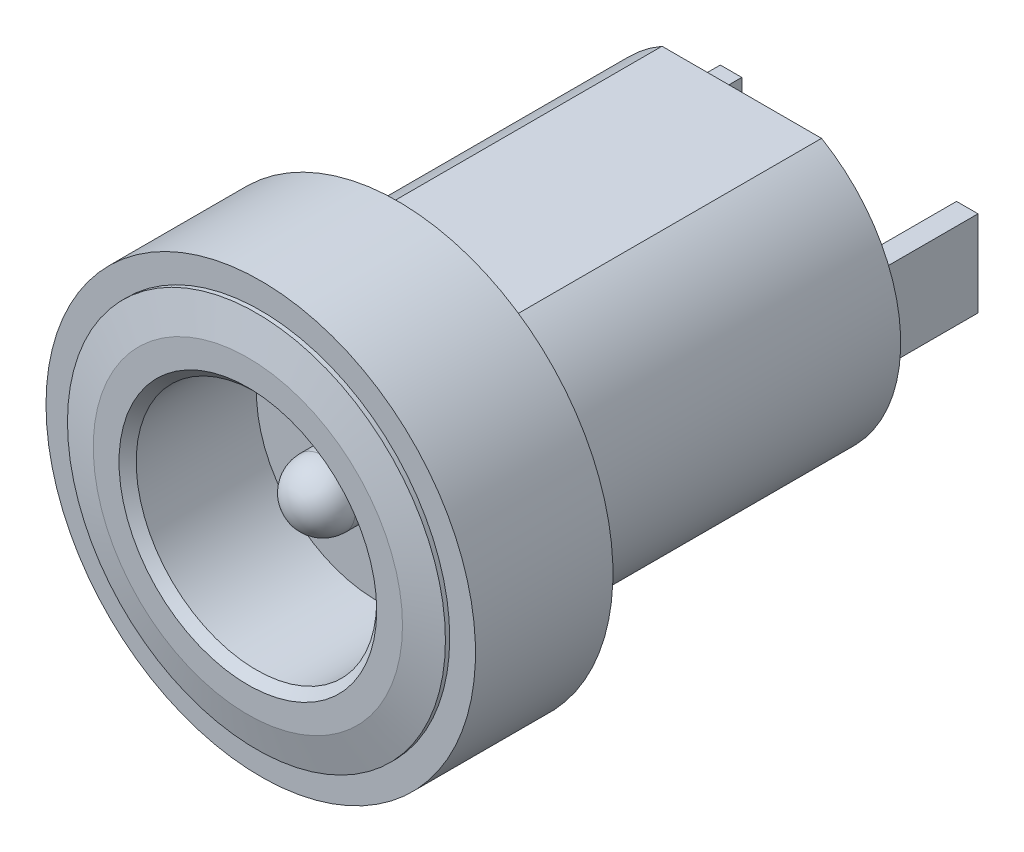
ISO-10303-21;
HEADER;
FILE_DESCRIPTION(('STEP AP214'),'2;1');
FILE_NAME('part.step','',(''),(''),'','','');
FILE_SCHEMA(('AUTOMOTIVE_DESIGN { 1 0 10303 214 1 1 1 1 }'));
ENDSEC;
DATA;
#1=APPLICATION_CONTEXT('core data for automotive mechanical design processes');
#2=APPLICATION_PROTOCOL_DEFINITION('international standard','automotive_design',2000,#1);
#3=PRODUCT_CONTEXT('',#1,'mechanical');
#4=PRODUCT('Part','Part','',(#3));
#5=PRODUCT_RELATED_PRODUCT_CATEGORY('part','',(#4));
#6=PRODUCT_DEFINITION_FORMATION('','',#4);
#7=PRODUCT_DEFINITION_CONTEXT('part definition',#1,'design');
#8=PRODUCT_DEFINITION('design','',#6,#7);
#9=PRODUCT_DEFINITION_SHAPE('','',#8);
#10=(LENGTH_UNIT() NAMED_UNIT(*) SI_UNIT(.MILLI.,.METRE.));
#11=(NAMED_UNIT(*) PLANE_ANGLE_UNIT() SI_UNIT($,.RADIAN.));
#12=(NAMED_UNIT(*) SI_UNIT($,.STERADIAN.) SOLID_ANGLE_UNIT());
#13=UNCERTAINTY_MEASURE_WITH_UNIT(LENGTH_MEASURE(1.E-05),#10,'distance_accuracy_value','');
#14=(GEOMETRIC_REPRESENTATION_CONTEXT(3) GLOBAL_UNCERTAINTY_ASSIGNED_CONTEXT((#13)) GLOBAL_UNIT_ASSIGNED_CONTEXT((#10,
#11,#12)) REPRESENTATION_CONTEXT('',''));
#15=CARTESIAN_POINT('',(0.,0.,0.));
#16=DIRECTION('',(0.,0.,1.));
#17=DIRECTION('',(1.,0.,0.));
#18=AXIS2_PLACEMENT_3D('',#15,#16,#17);
#19=CARTESIAN_POINT('',(0.,0.,0.));
#20=DIRECTION('',(0.,0.,1.));
#21=DIRECTION('',(1.,0.,0.));
#22=AXIS2_PLACEMENT_3D('',#19,#20,#21);
#23=PLANE('',#22);
#24=DIRECTION('',(1.,0.,0.));
#25=VECTOR('',#24,1.);
#26=CARTESIAN_POINT('',(0.928708781050336,-3.2,0.));
#27=LINE('',#26,#25);
#28=CARTESIAN_POINT('',(-1.85741756210067,-3.2,0.));
#29=VERTEX_POINT('',#28);
#30=CARTESIAN_POINT('',(1.85741756210067,-3.2,0.));
#31=VERTEX_POINT('',#30);
#32=EDGE_CURVE('E252',#29,#31,#27,.T.);
#33=ORIENTED_EDGE('',*,*,#32,.T.);
#34=CARTESIAN_POINT('',(0.,0.,0.));
#35=DIRECTION('',(0.,0.,1.));
#36=DIRECTION('',(1.,0.,0.));
#37=AXIS2_PLACEMENT_3D('',#34,#35,#36);
#38=CIRCLE('',#37,3.7);
#39=CARTESIAN_POINT('',(1.85741756210067,3.2,0.));
#40=VERTEX_POINT('',#39);
#41=EDGE_CURVE('E223',#31,#40,#38,.T.);
#42=ORIENTED_EDGE('',*,*,#41,.T.);
#43=DIRECTION('',(-1.,0.,0.));
#44=VECTOR('',#43,1.);
#45=CARTESIAN_POINT('',(-0.928708781050336,3.2,0.));
#46=LINE('',#45,#44);
#47=CARTESIAN_POINT('',(-1.85741756210067,3.2,0.));
#48=VERTEX_POINT('',#47);
#49=EDGE_CURVE('E203',#40,#48,#46,.T.);
#50=ORIENTED_EDGE('',*,*,#49,.T.);
#51=CARTESIAN_POINT('',(0.,0.,0.));
#52=DIRECTION('',(0.,0.,1.));
#53=DIRECTION('',(1.,0.,0.));
#54=AXIS2_PLACEMENT_3D('',#51,#52,#53);
#55=CIRCLE('',#54,3.7);
#56=EDGE_CURVE('E338',#48,#29,#55,.T.);
#57=ORIENTED_EDGE('',*,*,#56,.T.);
#58=EDGE_LOOP('',(#33,#42,#50,#57));
#59=FACE_BOUND('',#58,.T.);
#60=CARTESIAN_POINT('',(0.,0.,0.));
#61=DIRECTION('',(0.,0.,1.));
#62=DIRECTION('',(1.,0.,0.));
#63=AXIS2_PLACEMENT_3D('',#60,#61,#62);
#64=CIRCLE('',#63,5.);
#65=CARTESIAN_POINT('',(-5.,0.,0.));
#66=VERTEX_POINT('',#65);
#67=EDGE_CURVE('E11',#66,#66,#64,.T.);
#68=ORIENTED_EDGE('',*,*,#67,.F.);
#69=EDGE_LOOP('',(#68));
#70=FACE_BOUND('',#69,.T.);
#71=ADVANCED_FACE('F17',(#59,#70),#23,.F.);
#72=CARTESIAN_POINT('',(0.,0.,3.2));
#73=DIRECTION('',(0.,0.,1.));
#74=DIRECTION('',(1.,0.,0.));
#75=AXIS2_PLACEMENT_3D('',#72,#73,#74);
#76=PLANE('',#75);
#77=CARTESIAN_POINT('',(0.,0.,3.2));
#78=DIRECTION('',(0.,0.,-1.));
#79=DIRECTION('',(-1.,0.,0.));
#80=AXIS2_PLACEMENT_3D('',#77,#78,#79);
#81=CIRCLE('',#80,4.4);
#82=CARTESIAN_POINT('',(4.4,0.,3.2));
#83=VERTEX_POINT('',#82);
#84=EDGE_CURVE('E209',#83,#83,#81,.T.);
#85=ORIENTED_EDGE('',*,*,#84,.T.);
#86=EDGE_LOOP('',(#85));
#87=FACE_BOUND('',#86,.T.);
#88=CARTESIAN_POINT('',(0.,0.,3.2));
#89=DIRECTION('',(0.,0.,1.));
#90=DIRECTION('',(1.,0.,0.));
#91=AXIS2_PLACEMENT_3D('',#88,#89,#90);
#92=CIRCLE('',#91,5.);
#93=CARTESIAN_POINT('',(-5.,0.,3.2));
#94=VERTEX_POINT('',#93);
#95=EDGE_CURVE('E310',#94,#94,#92,.T.);
#96=ORIENTED_EDGE('',*,*,#95,.T.);
#97=EDGE_LOOP('',(#96));
#98=FACE_BOUND('',#97,.T.);
#99=ADVANCED_FACE('F386',(#87,#98),#76,.T.);
#100=CARTESIAN_POINT('',(0.,0.,0.));
#101=DIRECTION('',(0.,0.,1.));
#102=DIRECTION('',(1.,0.,0.));
#103=AXIS2_PLACEMENT_3D('',#100,#101,#102);
#104=CYLINDRICAL_SURFACE('',#103,5.);
#105=ORIENTED_EDGE('',*,*,#95,.F.);
#106=DIRECTION('',(0.,0.,-1.));
#107=VECTOR('',#106,1.);
#108=CARTESIAN_POINT('',(-5.,0.,0.));
#109=LINE('',#108,#107);
#110=EDGE_CURVE('E21',#94,#66,#109,.T.);
#111=ORIENTED_EDGE('',*,*,#110,.T.);
#112=ORIENTED_EDGE('',*,*,#67,.T.);
#113=ORIENTED_EDGE('',*,*,#110,.F.);
#114=EDGE_LOOP('',(#105,#111,#112,#113));
#115=FACE_BOUND('',#114,.T.);
#116=ADVANCED_FACE('F374',(#115),#104,.T.);
#117=CARTESIAN_POINT('',(0.,0.,0.5));
#118=DIRECTION('',(0.,0.,1.));
#119=DIRECTION('',(1.,0.,0.));
#120=AXIS2_PLACEMENT_3D('',#117,#118,#119);
#121=PLANE('',#120);
#122=CARTESIAN_POINT('',(0.,0.,0.5));
#123=DIRECTION('',(0.,0.,1.));
#124=DIRECTION('',(-1.,0.,0.));
#125=AXIS2_PLACEMENT_3D('',#122,#123,#124);
#126=CIRCLE('',#125,0.75);
#127=CARTESIAN_POINT('',(0.75,0.,0.5));
#128=VERTEX_POINT('',#127);
#129=EDGE_CURVE('E193',#128,#128,#126,.T.);
#130=ORIENTED_EDGE('',*,*,#129,.F.);
#131=EDGE_LOOP('',(#130));
#132=FACE_BOUND('',#131,.T.);
#133=CARTESIAN_POINT('',(0.,0.,0.5));
#134=DIRECTION('',(0.,0.,-1.));
#135=DIRECTION('',(-1.,0.,0.));
#136=AXIS2_PLACEMENT_3D('',#133,#134,#135);
#137=CIRCLE('',#136,2.8);
#138=CARTESIAN_POINT('',(2.8,0.,0.5));
#139=VERTEX_POINT('',#138);
#140=EDGE_CURVE('E280',#139,#139,#137,.T.);
#141=ORIENTED_EDGE('',*,*,#140,.F.);
#142=EDGE_LOOP('',(#141));
#143=FACE_BOUND('',#142,.T.);
#144=ADVANCED_FACE('F19',(#132,#143),#121,.T.);
#145=CARTESIAN_POINT('',(0.,0.,3.2));
#146=DIRECTION('',(0.,0.,1.));
#147=DIRECTION('',(-1.,0.,0.));
#148=AXIS2_PLACEMENT_3D('',#145,#146,#147);
#149=CYLINDRICAL_SURFACE('',#148,4.4);
#150=CARTESIAN_POINT('',(0.,0.,3.3));
#151=DIRECTION('',(0.,0.,1.));
#152=DIRECTION('',(-1.,0.,0.));
#153=AXIS2_PLACEMENT_3D('',#150,#151,#152);
#154=CIRCLE('',#153,4.4);
#155=CARTESIAN_POINT('',(4.4,0.,3.3));
#156=VERTEX_POINT('',#155);
#157=EDGE_CURVE('E210',#156,#156,#154,.T.);
#158=ORIENTED_EDGE('',*,*,#157,.F.);
#159=DIRECTION('',(0.,0.,-1.));
#160=VECTOR('',#159,1.);
#161=CARTESIAN_POINT('',(4.4,0.,3.2));
#162=LINE('',#161,#160);
#163=EDGE_CURVE('E205',#156,#83,#162,.T.);
#164=ORIENTED_EDGE('',*,*,#163,.T.);
#165=ORIENTED_EDGE('',*,*,#84,.F.);
#166=ORIENTED_EDGE('',*,*,#163,.F.);
#167=EDGE_LOOP('',(#158,#164,#165,#166));
#168=FACE_BOUND('',#167,.T.);
#169=ADVANCED_FACE('F373',(#168),#149,.T.);
#170=CARTESIAN_POINT('',(0.,0.,3.4));
#171=DIRECTION('',(0.,0.,-1.));
#172=DIRECTION('',(-1.,0.,0.));
#173=AXIS2_PLACEMENT_3D('',#170,#171,#172);
#174=CONICAL_SURFACE('',#173,4.,1.32581766366803);
#175=CARTESIAN_POINT('',(0.,0.,3.5));
#176=DIRECTION('',(0.,0.,-1.));
#177=DIRECTION('',(-1.,0.,0.));
#178=AXIS2_PLACEMENT_3D('',#175,#176,#177);
#179=CIRCLE('',#178,3.6);
#180=CARTESIAN_POINT('',(3.6,0.,3.5));
#181=VERTEX_POINT('',#180);
#182=EDGE_CURVE('E191',#181,#181,#179,.T.);
#183=ORIENTED_EDGE('',*,*,#182,.T.);
#184=DIRECTION('',(0.970142500145332,0.,-0.242535625036333));
#185=VECTOR('',#184,1.);
#186=CARTESIAN_POINT('',(4.,0.,3.4));
#187=LINE('',#186,#185);
#188=EDGE_CURVE('E276',#181,#156,#187,.T.);
#189=ORIENTED_EDGE('',*,*,#188,.T.);
#190=ORIENTED_EDGE('',*,*,#157,.T.);
#191=ORIENTED_EDGE('',*,*,#188,.F.);
#192=EDGE_LOOP('',(#183,#189,#190,#191));
#193=FACE_BOUND('',#192,.T.);
#194=ADVANCED_FACE('F383',(#193),#174,.T.);
#195=CARTESIAN_POINT('',(0.,0.,3.5));
#196=DIRECTION('',(0.,0.,-1.));
#197=DIRECTION('',(-1.,0.,0.));
#198=AXIS2_PLACEMENT_3D('',#195,#196,#197);
#199=CYLINDRICAL_SURFACE('',#198,2.8);
#200=CARTESIAN_POINT('',(0.,0.,3.3));
#201=DIRECTION('',(0.,0.,-1.));
#202=DIRECTION('',(-1.,0.,0.));
#203=AXIS2_PLACEMENT_3D('',#200,#201,#202);
#204=CIRCLE('',#203,2.8);
#205=CARTESIAN_POINT('',(2.8,0.,3.3));
#206=VERTEX_POINT('',#205);
#207=EDGE_CURVE('E183',#206,#206,#204,.T.);
#208=ORIENTED_EDGE('',*,*,#207,.F.);
#209=DIRECTION('',(0.,0.,-1.));
#210=VECTOR('',#209,1.);
#211=CARTESIAN_POINT('',(2.8,0.,3.5));
#212=LINE('',#211,#210);
#213=EDGE_CURVE('E297',#206,#139,#212,.T.);
#214=ORIENTED_EDGE('',*,*,#213,.T.);
#215=ORIENTED_EDGE('',*,*,#140,.T.);
#216=ORIENTED_EDGE('',*,*,#213,.F.);
#217=EDGE_LOOP('',(#208,#214,#215,#216));
#218=FACE_BOUND('',#217,.T.);
#219=ADVANCED_FACE('F369',(#218),#199,.F.);
#220=CARTESIAN_POINT('',(0.,0.,3.5));
#221=DIRECTION('',(0.,0.,1.));
#222=DIRECTION('',(1.,0.,0.));
#223=AXIS2_PLACEMENT_3D('',#220,#221,#222);
#224=PLANE('',#223);
#225=CARTESIAN_POINT('',(0.,0.,3.5));
#226=DIRECTION('',(0.,0.,1.));
#227=DIRECTION('',(-1.,0.,0.));
#228=AXIS2_PLACEMENT_3D('',#225,#226,#227);
#229=CIRCLE('',#228,3.);
#230=CARTESIAN_POINT('',(3.,0.,3.5));
#231=VERTEX_POINT('',#230);
#232=EDGE_CURVE('E181',#231,#231,#229,.T.);
#233=ORIENTED_EDGE('',*,*,#232,.F.);
#234=EDGE_LOOP('',(#233));
#235=FACE_BOUND('',#234,.T.);
#236=ORIENTED_EDGE('',*,*,#182,.F.);
#237=EDGE_LOOP('',(#236));
#238=FACE_BOUND('',#237,.T.);
#239=ADVANCED_FACE('F417',(#235,#238),#224,.T.);
#240=CARTESIAN_POINT('',(0.,0.,3.4));
#241=DIRECTION('',(0.,0.,1.));
#242=DIRECTION('',(-1.,0.,0.));
#243=AXIS2_PLACEMENT_3D('',#240,#241,#242);
#244=CONICAL_SURFACE('',#243,2.9,0.785398163397448);
#245=ORIENTED_EDGE('',*,*,#232,.T.);
#246=DIRECTION('',(-0.707106781186548,0.,-0.707106781186548));
#247=VECTOR('',#246,1.);
#248=CARTESIAN_POINT('',(2.9,0.,3.4));
#249=LINE('',#248,#247);
#250=EDGE_CURVE('E178',#231,#206,#249,.T.);
#251=ORIENTED_EDGE('',*,*,#250,.T.);
#252=ORIENTED_EDGE('',*,*,#207,.T.);
#253=ORIENTED_EDGE('',*,*,#250,.F.);
#254=EDGE_LOOP('',(#245,#251,#252,#253));
#255=FACE_BOUND('',#254,.T.);
#256=ADVANCED_FACE('F179',(#255),#244,.F.);
#257=CARTESIAN_POINT('',(0.,0.,3.5));
#258=DIRECTION('',(0.,0.,-1.));
#259=DIRECTION('',(-1.,0.,0.));
#260=AXIS2_PLACEMENT_3D('',#257,#258,#259);
#261=CYLINDRICAL_SURFACE('',#260,0.75);
#262=CARTESIAN_POINT('',(0.,0.,1.75));
#263=DIRECTION('',(0.,0.,1.));
#264=DIRECTION('',(-1.,0.,0.));
#265=AXIS2_PLACEMENT_3D('',#262,#263,#264);
#266=CIRCLE('',#265,0.75);
#267=CARTESIAN_POINT('',(0.75,0.,1.75));
#268=VERTEX_POINT('',#267);
#269=CARTESIAN_POINT('',(-0.75,0.,1.75));
#270=VERTEX_POINT('',#269);
#271=EDGE_CURVE('E257',#268,#270,#266,.T.);
#272=ORIENTED_EDGE('',*,*,#271,.F.);
#273=DIRECTION('',(0.,0.,-1.));
#274=VECTOR('',#273,1.);
#275=CARTESIAN_POINT('',(0.75,0.,3.5));
#276=LINE('',#275,#274);
#277=EDGE_CURVE('E269',#268,#128,#276,.T.);
#278=ORIENTED_EDGE('',*,*,#277,.T.);
#279=ORIENTED_EDGE('',*,*,#129,.T.);
#280=ORIENTED_EDGE('',*,*,#277,.F.);
#281=CARTESIAN_POINT('',(0.,0.,1.75));
#282=DIRECTION('',(0.,0.,1.));
#283=DIRECTION('',(-1.,0.,0.));
#284=AXIS2_PLACEMENT_3D('',#281,#282,#283);
#285=CIRCLE('',#284,0.75);
#286=EDGE_CURVE('E266',#270,#268,#285,.T.);
#287=ORIENTED_EDGE('',*,*,#286,.F.);
#288=EDGE_LOOP('',(#272,#278,#279,#280,#287));
#289=FACE_BOUND('',#288,.T.);
#290=ADVANCED_FACE('F432',(#289),#261,.T.);
#291=CARTESIAN_POINT('',(0.,0.,1.75));
#292=DIRECTION('',(0.,0.,1.));
#293=DIRECTION('',(1.,0.,0.));
#294=AXIS2_PLACEMENT_3D('',#291,#292,#293);
#295=SPHERICAL_SURFACE('',#294,0.75);
#296=ORIENTED_EDGE('',*,*,#271,.T.);
#297=CARTESIAN_POINT('',(0.,0.,1.75));
#298=DIRECTION('',(0.,-1.,0.));
#299=DIRECTION('',(-1.,0.,0.));
#300=AXIS2_PLACEMENT_3D('',#297,#298,#299);
#301=CIRCLE('',#300,0.75);
#302=CARTESIAN_POINT('',(0.,0.,2.5));
#303=VERTEX_POINT('',#302);
#304=EDGE_CURVE('E261',#303,#270,#301,.T.);
#305=ORIENTED_EDGE('',*,*,#304,.F.);
#306=ORIENTED_EDGE('',*,*,#304,.T.);
#307=ORIENTED_EDGE('',*,*,#286,.T.);
#308=EDGE_LOOP('',(#296,#305,#306,#307));
#309=FACE_BOUND('',#308,.T.);
#310=ADVANCED_FACE('F429',(#309),#295,.T.);
#311=CARTESIAN_POINT('',(0.,0.,-8.));
#312=DIRECTION('',(0.,0.,-1.));
#313=DIRECTION('',(0.,-1.,0.));
#314=AXIS2_PLACEMENT_3D('',#311,#312,#313);
#315=PLANE('',#314);
#316=DIRECTION('',(0.,-1.,0.));
#317=VECTOR('',#316,1.);
#318=CARTESIAN_POINT('',(-3.00000004470348,-0.500000007450581,-8.));
#319=LINE('',#318,#317);
#320=CARTESIAN_POINT('',(-3.00000004470348,1.00000001490116,-8.));
#321=VERTEX_POINT('',#320);
#322=CARTESIAN_POINT('',(-3.00000004470348,-1.00000001490116,-8.));
#323=VERTEX_POINT('',#322);
#324=EDGE_CURVE('E275',#321,#323,#319,.T.);
#325=ORIENTED_EDGE('',*,*,#324,.T.);
#326=DIRECTION('',(1.,0.,0.));
#327=VECTOR('',#326,1.);
#328=CARTESIAN_POINT('',(-1.25000001862645,-1.00000001490116,-8.));
#329=LINE('',#328,#327);
#330=CARTESIAN_POINT('',(-2.5000000372529,-1.00000001490116,-8.));
#331=VERTEX_POINT('',#330);
#332=EDGE_CURVE('E317',#323,#331,#329,.T.);
#333=ORIENTED_EDGE('',*,*,#332,.T.);
#334=DIRECTION('',(0.,1.,0.));
#335=VECTOR('',#334,1.);
#336=CARTESIAN_POINT('',(-2.5000000372529,0.500000007450581,-8.));
#337=LINE('',#336,#335);
#338=CARTESIAN_POINT('',(-2.5000000372529,1.00000001490116,-8.));
#339=VERTEX_POINT('',#338);
#340=EDGE_CURVE('E290',#331,#339,#337,.T.);
#341=ORIENTED_EDGE('',*,*,#340,.T.);
#342=DIRECTION('',(-1.,0.,0.));
#343=VECTOR('',#342,1.);
#344=CARTESIAN_POINT('',(-1.50000002235174,1.00000001490116,-8.));
#345=LINE('',#344,#343);
#346=EDGE_CURVE('E253',#339,#321,#345,.T.);
#347=ORIENTED_EDGE('',*,*,#346,.T.);
#348=EDGE_LOOP('',(#325,#333,#341,#347));
#349=FACE_BOUND('',#348,.T.);
#350=DIRECTION('',(-1.,0.,0.));
#351=VECTOR('',#350,1.);
#352=CARTESIAN_POINT('',(1.25000001862645,1.00000001490116,-8.));
#353=LINE('',#352,#351);
#354=CARTESIAN_POINT('',(3.00000004470348,1.00000001490116,-8.));
#355=VERTEX_POINT('',#354);
#356=CARTESIAN_POINT('',(2.5000000372529,1.00000001490116,-8.));
#357=VERTEX_POINT('',#356);
#358=EDGE_CURVE('E343',#355,#357,#353,.T.);
#359=ORIENTED_EDGE('',*,*,#358,.T.);
#360=DIRECTION('',(0.,-1.,0.));
#361=VECTOR('',#360,1.);
#362=CARTESIAN_POINT('',(2.5000000372529,-0.500000007450581,-8.));
#363=LINE('',#362,#361);
#364=CARTESIAN_POINT('',(2.5000000372529,-1.00000001490116,-8.));
#365=VERTEX_POINT('',#364);
#366=EDGE_CURVE('E236',#357,#365,#363,.T.);
#367=ORIENTED_EDGE('',*,*,#366,.T.);
#368=DIRECTION('',(1.,0.,0.));
#369=VECTOR('',#368,1.);
#370=CARTESIAN_POINT('',(1.50000002235174,-1.00000001490116,-8.));
#371=LINE('',#370,#369);
#372=CARTESIAN_POINT('',(3.00000004470348,-1.00000001490116,-8.));
#373=VERTEX_POINT('',#372);
#374=EDGE_CURVE('E231',#365,#373,#371,.T.);
#375=ORIENTED_EDGE('',*,*,#374,.T.);
#376=DIRECTION('',(0.,1.,0.));
#377=VECTOR('',#376,1.);
#378=CARTESIAN_POINT('',(3.00000004470348,0.500000007450581,-8.));
#379=LINE('',#378,#377);
#380=EDGE_CURVE('E238',#373,#355,#379,.T.);
#381=ORIENTED_EDGE('',*,*,#380,.T.);
#382=EDGE_LOOP('',(#359,#367,#375,#381));
#383=FACE_BOUND('',#382,.T.);
#384=CARTESIAN_POINT('',(0.,0.,-8.));
#385=DIRECTION('',(0.,0.,-1.));
#386=DIRECTION('',(1.,0.,0.));
#387=AXIS2_PLACEMENT_3D('',#384,#385,#386);
#388=CIRCLE('',#387,3.7);
#389=CARTESIAN_POINT('',(-1.85741756210067,-3.2,-8.));
#390=VERTEX_POINT('',#389);
#391=CARTESIAN_POINT('',(-1.85741756210067,3.2,-8.));
#392=VERTEX_POINT('',#391);
#393=EDGE_CURVE('E262',#390,#392,#388,.T.);
#394=ORIENTED_EDGE('',*,*,#393,.T.);
#395=DIRECTION('',(1.,0.,0.));
#396=VECTOR('',#395,1.);
#397=CARTESIAN_POINT('',(-2.44398960113968,3.2,-8.));
#398=LINE('',#397,#396);
#399=CARTESIAN_POINT('',(1.85741756210067,3.2,-8.));
#400=VERTEX_POINT('',#399);
#401=EDGE_CURVE('E211',#392,#400,#398,.T.);
#402=ORIENTED_EDGE('',*,*,#401,.T.);
#403=CARTESIAN_POINT('',(0.,0.,-8.));
#404=DIRECTION('',(0.,0.,-1.));
#405=DIRECTION('',(1.,0.,0.));
#406=AXIS2_PLACEMENT_3D('',#403,#404,#405);
#407=CIRCLE('',#406,3.7);
#408=CARTESIAN_POINT('',(1.85741756210067,-3.2,-8.));
#409=VERTEX_POINT('',#408);
#410=EDGE_CURVE('E204',#400,#409,#407,.T.);
#411=ORIENTED_EDGE('',*,*,#410,.T.);
#412=DIRECTION('',(-1.,0.,0.));
#413=VECTOR('',#412,1.);
#414=CARTESIAN_POINT('',(-2.27201818930037,-3.2,-8.));
#415=LINE('',#414,#413);
#416=EDGE_CURVE('E217',#409,#390,#415,.T.);
#417=ORIENTED_EDGE('',*,*,#416,.T.);
#418=EDGE_LOOP('',(#394,#402,#411,#417));
#419=FACE_BOUND('',#418,.T.);
#420=ADVANCED_FACE('F431',(#349,#383,#419),#315,.T.);
#421=CARTESIAN_POINT('',(0.,0.,0.));
#422=DIRECTION('',(0.,0.,-1.));
#423=DIRECTION('',(-1.,0.,0.));
#424=AXIS2_PLACEMENT_3D('',#421,#422,#423);
#425=CYLINDRICAL_SURFACE('',#424,3.7);
#426=ORIENTED_EDGE('',*,*,#56,.F.);
#427=DIRECTION('',(0.,0.,-1.));
#428=VECTOR('',#427,1.);
#429=CARTESIAN_POINT('',(-1.85741756210067,3.2,0.));
#430=LINE('',#429,#428);
#431=EDGE_CURVE('E197',#48,#392,#430,.T.);
#432=ORIENTED_EDGE('',*,*,#431,.T.);
#433=ORIENTED_EDGE('',*,*,#393,.F.);
#434=DIRECTION('',(0.,0.,-1.));
#435=VECTOR('',#434,1.);
#436=CARTESIAN_POINT('',(-1.85741756210067,-3.2,0.));
#437=LINE('',#436,#435);
#438=EDGE_CURVE('E222',#29,#390,#437,.T.);
#439=ORIENTED_EDGE('',*,*,#438,.F.);
#440=EDGE_LOOP('',(#426,#432,#433,#439));
#441=FACE_BOUND('',#440,.T.);
#442=ADVANCED_FACE('F439',(#441),#425,.T.);
#443=CARTESIAN_POINT('',(-1.85741756210067,3.2,0.));
#444=DIRECTION('',(0.,1.,0.));
#445=DIRECTION('',(1.,0.,0.));
#446=AXIS2_PLACEMENT_3D('',#443,#444,#445);
#447=PLANE('',#446);
#448=ORIENTED_EDGE('',*,*,#49,.F.);
#449=DIRECTION('',(0.,0.,-1.));
#450=VECTOR('',#449,1.);
#451=CARTESIAN_POINT('',(1.85741756210067,3.2,0.));
#452=LINE('',#451,#450);
#453=EDGE_CURVE('E199',#40,#400,#452,.T.);
#454=ORIENTED_EDGE('',*,*,#453,.T.);
#455=ORIENTED_EDGE('',*,*,#401,.F.);
#456=ORIENTED_EDGE('',*,*,#431,.F.);
#457=EDGE_LOOP('',(#448,#454,#455,#456));
#458=FACE_BOUND('',#457,.T.);
#459=ADVANCED_FACE('F435',(#458),#447,.T.);
#460=CARTESIAN_POINT('',(0.,0.,0.));
#461=DIRECTION('',(0.,0.,-1.));
#462=DIRECTION('',(1.,0.,0.));
#463=AXIS2_PLACEMENT_3D('',#460,#461,#462);
#464=CYLINDRICAL_SURFACE('',#463,3.7);
#465=ORIENTED_EDGE('',*,*,#41,.F.);
#466=DIRECTION('',(0.,0.,-1.));
#467=VECTOR('',#466,1.);
#468=CARTESIAN_POINT('',(1.85741756210067,-3.2,0.));
#469=LINE('',#468,#467);
#470=EDGE_CURVE('E221',#31,#409,#469,.T.);
#471=ORIENTED_EDGE('',*,*,#470,.T.);
#472=ORIENTED_EDGE('',*,*,#410,.F.);
#473=ORIENTED_EDGE('',*,*,#453,.F.);
#474=EDGE_LOOP('',(#465,#471,#472,#473));
#475=FACE_BOUND('',#474,.T.);
#476=ADVANCED_FACE('F438',(#475),#464,.T.);
#477=CARTESIAN_POINT('',(1.85741756210067,-3.2,0.));
#478=DIRECTION('',(0.,-1.,0.));
#479=DIRECTION('',(0.,0.,-1.));
#480=AXIS2_PLACEMENT_3D('',#477,#478,#479);
#481=PLANE('',#480);
#482=ORIENTED_EDGE('',*,*,#32,.F.);
#483=ORIENTED_EDGE('',*,*,#438,.T.);
#484=ORIENTED_EDGE('',*,*,#416,.F.);
#485=ORIENTED_EDGE('',*,*,#470,.F.);
#486=EDGE_LOOP('',(#482,#483,#484,#485));
#487=FACE_BOUND('',#486,.T.);
#488=ADVANCED_FACE('F427',(#487),#481,.T.);
#489=CARTESIAN_POINT('',(-2.75000004097819,0.,-10.5));
#490=DIRECTION('',(0.,0.,-1.));
#491=DIRECTION('',(0.,-1.,0.));
#492=AXIS2_PLACEMENT_3D('',#489,#490,#491);
#493=PLANE('',#492);
#494=DIRECTION('',(1.,0.,0.));
#495=VECTOR('',#494,1.);
#496=CARTESIAN_POINT('',(-2.5000000372529,1.00000001490116,-10.5));
#497=LINE('',#496,#495);
#498=CARTESIAN_POINT('',(-3.00000004470348,1.00000001490116,-10.5));
#499=VERTEX_POINT('',#498);
#500=CARTESIAN_POINT('',(-2.5000000372529,1.00000001490116,-10.5));
#501=VERTEX_POINT('',#500);
#502=EDGE_CURVE('E249',#499,#501,#497,.T.);
#503=ORIENTED_EDGE('',*,*,#502,.T.);
#504=DIRECTION('',(0.,-1.,0.));
#505=VECTOR('',#504,1.);
#506=CARTESIAN_POINT('',(-2.5000000372529,-1.00000001490116,-10.5));
#507=LINE('',#506,#505);
#508=CARTESIAN_POINT('',(-2.5000000372529,-1.00000001490116,-10.5));
#509=VERTEX_POINT('',#508);
#510=EDGE_CURVE('E287',#501,#509,#507,.T.);
#511=ORIENTED_EDGE('',*,*,#510,.T.);
#512=DIRECTION('',(-1.,0.,0.));
#513=VECTOR('',#512,1.);
#514=CARTESIAN_POINT('',(-3.00000004470348,-1.00000001490116,-10.5));
#515=LINE('',#514,#513);
#516=CARTESIAN_POINT('',(-3.00000004470348,-1.00000001490116,-10.5));
#517=VERTEX_POINT('',#516);
#518=EDGE_CURVE('E321',#509,#517,#515,.T.);
#519=ORIENTED_EDGE('',*,*,#518,.T.);
#520=DIRECTION('',(0.,1.,0.));
#521=VECTOR('',#520,1.);
#522=CARTESIAN_POINT('',(-3.00000004470348,1.00000001490116,-10.5));
#523=LINE('',#522,#521);
#524=EDGE_CURVE('E274',#517,#499,#523,.T.);
#525=ORIENTED_EDGE('',*,*,#524,.T.);
#526=EDGE_LOOP('',(#503,#511,#519,#525));
#527=FACE_BOUND('',#526,.T.);
#528=ADVANCED_FACE('F423',(#527),#493,.T.);
#529=CARTESIAN_POINT('',(-3.00000004470348,1.00000001490116,-8.));
#530=DIRECTION('',(0.,1.,0.));
#531=DIRECTION('',(1.,0.,0.));
#532=AXIS2_PLACEMENT_3D('',#529,#530,#531);
#533=PLANE('',#532);
#534=ORIENTED_EDGE('',*,*,#346,.F.);
#535=DIRECTION('',(0.,0.,-1.));
#536=VECTOR('',#535,1.);
#537=CARTESIAN_POINT('',(-2.5000000372529,1.00000001490116,-8.));
#538=LINE('',#537,#536);
#539=EDGE_CURVE('E283',#339,#501,#538,.T.);
#540=ORIENTED_EDGE('',*,*,#539,.T.);
#541=ORIENTED_EDGE('',*,*,#502,.F.);
#542=DIRECTION('',(0.,0.,-1.));
#543=VECTOR('',#542,1.);
#544=CARTESIAN_POINT('',(-3.00000004470348,1.00000001490116,-8.));
#545=LINE('',#544,#543);
#546=EDGE_CURVE('E270',#321,#499,#545,.T.);
#547=ORIENTED_EDGE('',*,*,#546,.F.);
#548=EDGE_LOOP('',(#534,#540,#541,#547));
#549=FACE_BOUND('',#548,.T.);
#550=ADVANCED_FACE('F426',(#549),#533,.T.);
#551=CARTESIAN_POINT('',(-2.5000000372529,1.00000001490116,-8.));
#552=DIRECTION('',(1.,0.,0.));
#553=DIRECTION('',(0.,1.,0.));
#554=AXIS2_PLACEMENT_3D('',#551,#552,#553);
#555=PLANE('',#554);
#556=ORIENTED_EDGE('',*,*,#340,.F.);
#557=DIRECTION('',(0.,0.,-1.));
#558=VECTOR('',#557,1.);
#559=CARTESIAN_POINT('',(-2.5000000372529,-1.00000001490116,-8.));
#560=LINE('',#559,#558);
#561=EDGE_CURVE('E334',#331,#509,#560,.T.);
#562=ORIENTED_EDGE('',*,*,#561,.T.);
#563=ORIENTED_EDGE('',*,*,#510,.F.);
#564=ORIENTED_EDGE('',*,*,#539,.F.);
#565=EDGE_LOOP('',(#556,#562,#563,#564));
#566=FACE_BOUND('',#565,.T.);
#567=ADVANCED_FACE('F504',(#566),#555,.T.);
#568=CARTESIAN_POINT('',(-2.5000000372529,-1.00000001490116,-8.));
#569=DIRECTION('',(0.,-1.,0.));
#570=DIRECTION('',(0.,0.,-1.));
#571=AXIS2_PLACEMENT_3D('',#568,#569,#570);
#572=PLANE('',#571);
#573=ORIENTED_EDGE('',*,*,#332,.F.);
#574=DIRECTION('',(0.,0.,-1.));
#575=VECTOR('',#574,1.);
#576=CARTESIAN_POINT('',(-3.00000004470348,-1.00000001490116,-8.));
#577=LINE('',#576,#575);
#578=EDGE_CURVE('E294',#323,#517,#577,.T.);
#579=ORIENTED_EDGE('',*,*,#578,.T.);
#580=ORIENTED_EDGE('',*,*,#518,.F.);
#581=ORIENTED_EDGE('',*,*,#561,.F.);
#582=EDGE_LOOP('',(#573,#579,#580,#581));
#583=FACE_BOUND('',#582,.T.);
#584=ADVANCED_FACE('F421',(#583),#572,.T.);
#585=CARTESIAN_POINT('',(-3.00000004470348,-1.00000001490116,-8.));
#586=DIRECTION('',(-1.,0.,0.));
#587=DIRECTION('',(0.,0.,1.));
#588=AXIS2_PLACEMENT_3D('',#585,#586,#587);
#589=PLANE('',#588);
#590=ORIENTED_EDGE('',*,*,#324,.F.);
#591=ORIENTED_EDGE('',*,*,#546,.T.);
#592=ORIENTED_EDGE('',*,*,#524,.F.);
#593=ORIENTED_EDGE('',*,*,#578,.F.);
#594=EDGE_LOOP('',(#590,#591,#592,#593));
#595=FACE_BOUND('',#594,.T.);
#596=ADVANCED_FACE('F418',(#595),#589,.T.);
#597=CARTESIAN_POINT('',(2.75000004097819,0.,-10.5));
#598=DIRECTION('',(0.,0.,-1.));
#599=DIRECTION('',(0.,-1.,0.));
#600=AXIS2_PLACEMENT_3D('',#597,#598,#599);
#601=PLANE('',#600);
#602=DIRECTION('',(0.,-1.,0.));
#603=VECTOR('',#602,1.);
#604=CARTESIAN_POINT('',(3.00000004470348,1.00000001490116,-10.5));
#605=LINE('',#604,#603);
#606=CARTESIAN_POINT('',(3.00000004470348,1.00000001490116,-10.5));
#607=VERTEX_POINT('',#606);
#608=CARTESIAN_POINT('',(3.00000004470348,-1.00000001490116,-10.5));
#609=VERTEX_POINT('',#608);
#610=EDGE_CURVE('E241',#607,#609,#605,.T.);
#611=ORIENTED_EDGE('',*,*,#610,.T.);
#612=DIRECTION('',(-1.,0.,0.));
#613=VECTOR('',#612,1.);
#614=CARTESIAN_POINT('',(3.00000004470348,-1.00000001490116,-10.5));
#615=LINE('',#614,#613);
#616=CARTESIAN_POINT('',(2.5000000372529,-1.00000001490116,-10.5));
#617=VERTEX_POINT('',#616);
#618=EDGE_CURVE('E227',#609,#617,#615,.T.);
#619=ORIENTED_EDGE('',*,*,#618,.T.);
#620=DIRECTION('',(0.,1.,0.));
#621=VECTOR('',#620,1.);
#622=CARTESIAN_POINT('',(2.5000000372529,-1.00000001490116,-10.5));
#623=LINE('',#622,#621);
#624=CARTESIAN_POINT('',(2.5000000372529,1.00000001490116,-10.5));
#625=VERTEX_POINT('',#624);
#626=EDGE_CURVE('E242',#617,#625,#623,.T.);
#627=ORIENTED_EDGE('',*,*,#626,.T.);
#628=DIRECTION('',(1.,0.,0.));
#629=VECTOR('',#628,1.);
#630=CARTESIAN_POINT('',(2.5000000372529,1.00000001490116,-10.5));
#631=LINE('',#630,#629);
#632=EDGE_CURVE('E237',#625,#607,#631,.T.);
#633=ORIENTED_EDGE('',*,*,#632,.T.);
#634=EDGE_LOOP('',(#611,#619,#627,#633));
#635=FACE_BOUND('',#634,.T.);
#636=ADVANCED_FACE('F412',(#635),#601,.T.);
#637=CARTESIAN_POINT('',(3.00000004470348,1.00000001490116,-8.));
#638=DIRECTION('',(1.,0.,0.));
#639=DIRECTION('',(0.,1.,0.));
#640=AXIS2_PLACEMENT_3D('',#637,#638,#639);
#641=PLANE('',#640);
#642=ORIENTED_EDGE('',*,*,#380,.F.);
#643=DIRECTION('',(0.,0.,-1.));
#644=VECTOR('',#643,1.);
#645=CARTESIAN_POINT('',(3.00000004470348,-1.00000001490116,-8.));
#646=LINE('',#645,#644);
#647=EDGE_CURVE('E230',#373,#609,#646,.T.);
#648=ORIENTED_EDGE('',*,*,#647,.T.);
#649=ORIENTED_EDGE('',*,*,#610,.F.);
#650=DIRECTION('',(0.,0.,-1.));
#651=VECTOR('',#650,1.);
#652=CARTESIAN_POINT('',(3.00000004470348,1.00000001490116,-8.));
#653=LINE('',#652,#651);
#654=EDGE_CURVE('E325',#355,#607,#653,.T.);
#655=ORIENTED_EDGE('',*,*,#654,.F.);
#656=EDGE_LOOP('',(#642,#648,#649,#655));
#657=FACE_BOUND('',#656,.T.);
#658=ADVANCED_FACE('F409',(#657),#641,.T.);
#659=CARTESIAN_POINT('',(3.00000004470348,-1.00000001490116,-8.));
#660=DIRECTION('',(0.,-1.,0.));
#661=DIRECTION('',(0.,0.,-1.));
#662=AXIS2_PLACEMENT_3D('',#659,#660,#661);
#663=PLANE('',#662);
#664=ORIENTED_EDGE('',*,*,#374,.F.);
#665=DIRECTION('',(0.,0.,-1.));
#666=VECTOR('',#665,1.);
#667=CARTESIAN_POINT('',(2.5000000372529,-1.00000001490116,-8.));
#668=LINE('',#667,#666);
#669=EDGE_CURVE('E245',#365,#617,#668,.T.);
#670=ORIENTED_EDGE('',*,*,#669,.T.);
#671=ORIENTED_EDGE('',*,*,#618,.F.);
#672=ORIENTED_EDGE('',*,*,#647,.F.);
#673=EDGE_LOOP('',(#664,#670,#671,#672));
#674=FACE_BOUND('',#673,.T.);
#675=ADVANCED_FACE('F406',(#674),#663,.T.);
#676=CARTESIAN_POINT('',(2.5000000372529,-1.00000001490116,-8.));
#677=DIRECTION('',(-1.,0.,0.));
#678=DIRECTION('',(0.,0.,1.));
#679=AXIS2_PLACEMENT_3D('',#676,#677,#678);
#680=PLANE('',#679);
#681=ORIENTED_EDGE('',*,*,#366,.F.);
#682=DIRECTION('',(0.,0.,-1.));
#683=VECTOR('',#682,1.);
#684=CARTESIAN_POINT('',(2.5000000372529,1.00000001490116,-8.));
#685=LINE('',#684,#683);
#686=EDGE_CURVE('E232',#357,#625,#685,.T.);
#687=ORIENTED_EDGE('',*,*,#686,.T.);
#688=ORIENTED_EDGE('',*,*,#626,.F.);
#689=ORIENTED_EDGE('',*,*,#669,.F.);
#690=EDGE_LOOP('',(#681,#687,#688,#689));
#691=FACE_BOUND('',#690,.T.);
#692=ADVANCED_FACE('F405',(#691),#680,.T.);
#693=CARTESIAN_POINT('',(2.5000000372529,1.00000001490116,-8.));
#694=DIRECTION('',(0.,1.,0.));
#695=DIRECTION('',(1.,0.,0.));
#696=AXIS2_PLACEMENT_3D('',#693,#694,#695);
#697=PLANE('',#696);
#698=ORIENTED_EDGE('',*,*,#358,.F.);
#699=ORIENTED_EDGE('',*,*,#654,.T.);
#700=ORIENTED_EDGE('',*,*,#632,.F.);
#701=ORIENTED_EDGE('',*,*,#686,.F.);
#702=EDGE_LOOP('',(#698,#699,#700,#701));
#703=FACE_BOUND('',#702,.T.);
#704=ADVANCED_FACE('F402',(#703),#697,.T.);
#705=CLOSED_SHELL('',(#71,#99,#116,#144,#169,#194,#219,#239,#256,#290,#310,#420,#442,#459,#476,
#488,#528,#550,#567,#584,#596,#636,#658,#675,#692,#704));
#706=MANIFOLD_SOLID_BREP('B1',#705);
#707=ADVANCED_BREP_SHAPE_REPRESENTATION('',(#18,#706),#14);
#708=SHAPE_DEFINITION_REPRESENTATION(#9,#707);
ENDSEC;
END-ISO-10303-21;
